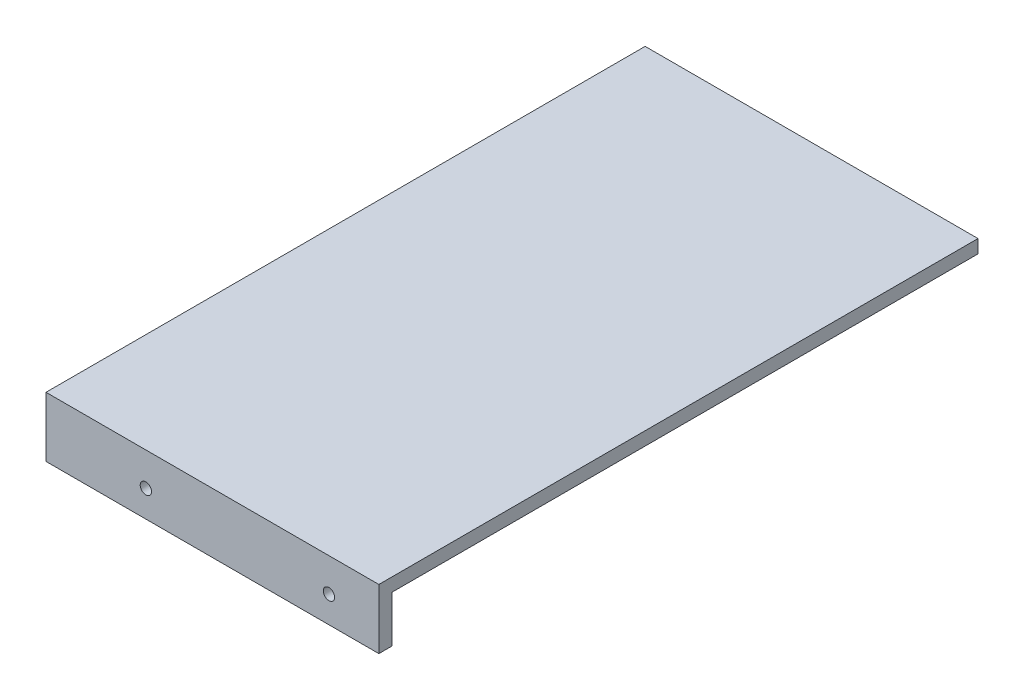
ISO-10303-21;
HEADER;
FILE_DESCRIPTION(('STEP AP214'),'2;1');
FILE_NAME('part.step','',(''),(''),'','','');
FILE_SCHEMA(('AUTOMOTIVE_DESIGN { 1 0 10303 214 1 1 1 1 }'));
ENDSEC;
DATA;
#1=APPLICATION_CONTEXT('core data for automotive mechanical design processes');
#2=APPLICATION_PROTOCOL_DEFINITION('international standard','automotive_design',2000,#1);
#3=PRODUCT_CONTEXT('',#1,'mechanical');
#4=PRODUCT('Part','Part','',(#3));
#5=PRODUCT_RELATED_PRODUCT_CATEGORY('part','',(#4));
#6=PRODUCT_DEFINITION_FORMATION('','',#4);
#7=PRODUCT_DEFINITION_CONTEXT('part definition',#1,'design');
#8=PRODUCT_DEFINITION('design','',#6,#7);
#9=PRODUCT_DEFINITION_SHAPE('','',#8);
#10=(LENGTH_UNIT() NAMED_UNIT(*) SI_UNIT(.MILLI.,.METRE.));
#11=(NAMED_UNIT(*) PLANE_ANGLE_UNIT() SI_UNIT($,.RADIAN.));
#12=(NAMED_UNIT(*) SI_UNIT($,.STERADIAN.) SOLID_ANGLE_UNIT());
#13=UNCERTAINTY_MEASURE_WITH_UNIT(LENGTH_MEASURE(1.E-05),#10,'distance_accuracy_value','');
#14=(GEOMETRIC_REPRESENTATION_CONTEXT(3) GLOBAL_UNCERTAINTY_ASSIGNED_CONTEXT((#13)) GLOBAL_UNIT_ASSIGNED_CONTEXT((#10,
#11,#12)) REPRESENTATION_CONTEXT('',''));
#15=CARTESIAN_POINT('',(0.,0.,0.));
#16=DIRECTION('',(0.,0.,1.));
#17=DIRECTION('',(1.,0.,0.));
#18=AXIS2_PLACEMENT_3D('',#15,#16,#17);
#19=CARTESIAN_POINT('',(-1643.16952854318,0.,0.));
#20=DIRECTION('',(1.,0.,0.));
#21=DIRECTION('',(0.,0.,-1.));
#22=AXIS2_PLACEMENT_3D('',#19,#20,#21);
#23=PLANE('',#22);
#24=CARTESIAN_POINT('',(-1643.16952854318,759.849345995239,1219.82566669182));
#25=DIRECTION('',(1.,0.,0.));
#26=DIRECTION('',(0.,1.,0.));
#27=AXIS2_PLACEMENT_3D('',#24,#25,#26);
#28=CIRCLE('',#27,1.69999999999995);
#29=CARTESIAN_POINT('',(-1643.16952854318,761.549345995239,1219.82566669182));
#30=VERTEX_POINT('',#29);
#31=EDGE_CURVE('E146',#30,#30,#28,.T.);
#32=ORIENTED_EDGE('',*,*,#31,.F.);
#33=EDGE_LOOP('',(#32));
#34=FACE_BOUND('',#33,.T.);
#35=CARTESIAN_POINT('',(-1643.16952854318,759.849345995239,1339.82566669182));
#36=DIRECTION('',(1.,0.,0.));
#37=DIRECTION('',(0.,1.,0.));
#38=AXIS2_PLACEMENT_3D('',#35,#36,#37);
#39=CIRCLE('',#38,1.69999999999995);
#40=CARTESIAN_POINT('',(-1643.16952854318,761.549345995239,1339.82566669182));
#41=VERTEX_POINT('',#40);
#42=EDGE_CURVE('E140',#41,#41,#39,.T.);
#43=ORIENTED_EDGE('',*,*,#42,.F.);
#44=EDGE_LOOP('',(#43));
#45=FACE_BOUND('',#44,.T.);
#46=DIRECTION('',(0.,1.,0.));
#47=VECTOR('',#46,1.);
#48=CARTESIAN_POINT('',(-1643.16952854318,769.849345995239,1189.82566669182));
#49=LINE('',#48,#47);
#50=CARTESIAN_POINT('',(-1643.16952854318,751.849345995239,1189.82566669182));
#51=VERTEX_POINT('',#50);
#52=CARTESIAN_POINT('',(-1643.16952854318,765.849345995238,1189.82566669182));
#53=VERTEX_POINT('',#52);
#54=EDGE_CURVE('E48',#51,#53,#49,.T.);
#55=ORIENTED_EDGE('',*,*,#54,.T.);
#56=DIRECTION('',(0.,0.,1.));
#57=VECTOR('',#56,1.);
#58=CARTESIAN_POINT('',(-1643.16952854318,765.849345995238,1093.74236949611));
#59=LINE('',#58,#57);
#60=CARTESIAN_POINT('',(-1643.16952854318,765.849345995238,1365.82566669183));
#61=VERTEX_POINT('',#60);
#62=EDGE_CURVE('E53',#53,#61,#59,.T.);
#63=ORIENTED_EDGE('',*,*,#62,.T.);
#64=DIRECTION('',(0.,-1.,0.));
#65=VECTOR('',#64,1.);
#66=CARTESIAN_POINT('',(-1643.16952854318,0.,1365.82566669183));
#67=LINE('',#66,#65);
#68=CARTESIAN_POINT('',(-1643.16952854318,751.849345995251,1365.82566669183));
#69=VERTEX_POINT('',#68);
#70=EDGE_CURVE('E110',#61,#69,#67,.T.);
#71=ORIENTED_EDGE('',*,*,#70,.T.);
#72=DIRECTION('',(0.,0.,-1.));
#73=VECTOR('',#72,1.);
#74=CARTESIAN_POINT('',(-1643.16952854318,751.849345995239,1369.82566669182));
#75=LINE('',#74,#73);
#76=EDGE_CURVE('E152',#69,#51,#75,.T.);
#77=ORIENTED_EDGE('',*,*,#76,.T.);
#78=EDGE_LOOP('',(#55,#63,#71,#77));
#79=FACE_BOUND('',#78,.T.);
#80=ADVANCED_FACE('F33',(#34,#45,#79),#23,.T.);
#81=CARTESIAN_POINT('',(6.06928205417968E-12,0.,1365.82566669182));
#82=DIRECTION('',(0.,0.,1.));
#83=DIRECTION('',(1.,0.,0.));
#84=AXIS2_PLACEMENT_3D('',#81,#82,#83);
#85=PLANE('',#84);
#86=CARTESIAN_POINT('',(-1562.16952854317,759.849345995251,1365.82566669183));
#87=DIRECTION('',(0.,0.,-1.));
#88=DIRECTION('',(-1.,0.,0.));
#89=AXIS2_PLACEMENT_3D('',#86,#87,#88);
#90=CIRCLE('',#89,1.69999999999995);
#91=CARTESIAN_POINT('',(-1563.86952854317,759.849345995251,1365.82566669183));
#92=VERTEX_POINT('',#91);
#93=EDGE_CURVE('E120',#92,#92,#90,.T.);
#94=ORIENTED_EDGE('',*,*,#93,.F.);
#95=EDGE_LOOP('',(#94));
#96=FACE_BOUND('',#95,.T.);
#97=CARTESIAN_POINT('',(-1617.16952854317,759.849345995251,1365.82566669183));
#98=DIRECTION('',(0.,0.,-1.));
#99=DIRECTION('',(-1.,0.,0.));
#100=AXIS2_PLACEMENT_3D('',#97,#98,#99);
#101=CIRCLE('',#100,1.69999999999995);
#102=CARTESIAN_POINT('',(-1618.86952854317,759.849345995251,1365.82566669183));
#103=VERTEX_POINT('',#102);
#104=EDGE_CURVE('E127',#103,#103,#101,.T.);
#105=ORIENTED_EDGE('',*,*,#104,.F.);
#106=EDGE_LOOP('',(#105));
#107=FACE_BOUND('',#106,.T.);
#108=DIRECTION('',(-1.,0.,0.));
#109=VECTOR('',#108,1.);
#110=CARTESIAN_POINT('',(-1547.16952854317,765.849345995238,1365.82566669183));
#111=LINE('',#110,#109);
#112=CARTESIAN_POINT('',(-1547.16952854317,765.849345995238,1365.82566669183));
#113=VERTEX_POINT('',#112);
#114=EDGE_CURVE('E108',#113,#61,#111,.T.);
#115=ORIENTED_EDGE('',*,*,#114,.F.);
#116=DIRECTION('',(0.,-1.,0.));
#117=VECTOR('',#116,1.);
#118=CARTESIAN_POINT('',(-1547.16952854317,769.849345995238,1365.82566669183));
#119=LINE('',#118,#117);
#120=CARTESIAN_POINT('',(-1547.16952854317,751.849345995251,1365.82566669183));
#121=VERTEX_POINT('',#120);
#122=EDGE_CURVE('E91',#113,#121,#119,.T.);
#123=ORIENTED_EDGE('',*,*,#122,.T.);
#124=DIRECTION('',(-1.,0.,0.));
#125=VECTOR('',#124,1.);
#126=CARTESIAN_POINT('',(-1647.16952854317,751.849345995251,1365.82566669183));
#127=LINE('',#126,#125);
#128=EDGE_CURVE('E104',#121,#69,#127,.T.);
#129=ORIENTED_EDGE('',*,*,#128,.T.);
#130=ORIENTED_EDGE('',*,*,#70,.F.);
#131=EDGE_LOOP('',(#115,#123,#129,#130));
#132=FACE_BOUND('',#131,.T.);
#133=ADVANCED_FACE('F109',(#96,#107,#132),#85,.F.);
#134=CARTESIAN_POINT('',(-1647.16952854318,0.,0.));
#135=DIRECTION('',(1.,0.,0.));
#136=DIRECTION('',(0.,0.,-1.));
#137=AXIS2_PLACEMENT_3D('',#134,#135,#136);
#138=PLANE('',#137);
#139=DIRECTION('',(0.,-1.,0.));
#140=VECTOR('',#139,1.);
#141=CARTESIAN_POINT('',(-1647.16952854318,769.849345995239,1369.82566669182));
#142=LINE('',#141,#140);
#143=CARTESIAN_POINT('',(-1647.16952854318,769.849345995239,1369.82566669182));
#144=VERTEX_POINT('',#143);
#145=CARTESIAN_POINT('',(-1647.16952854318,751.849345995239,1369.82566669182));
#146=VERTEX_POINT('',#145);
#147=EDGE_CURVE('E149',#144,#146,#142,.T.);
#148=ORIENTED_EDGE('',*,*,#147,.F.);
#149=DIRECTION('',(0.,0.,1.));
#150=VECTOR('',#149,1.);
#151=CARTESIAN_POINT('',(-1647.16952854318,769.849345995239,1369.82566669182));
#152=LINE('',#151,#150);
#153=CARTESIAN_POINT('',(-1647.16952854318,769.849345995239,1189.82566669182));
#154=VERTEX_POINT('',#153);
#155=EDGE_CURVE('E154',#154,#144,#152,.T.);
#156=ORIENTED_EDGE('',*,*,#155,.F.);
#157=DIRECTION('',(0.,1.,0.));
#158=VECTOR('',#157,1.);
#159=CARTESIAN_POINT('',(-1647.16952854318,769.849345995239,1189.82566669182));
#160=LINE('',#159,#158);
#161=CARTESIAN_POINT('',(-1647.16952854318,751.849345995239,1189.82566669182));
#162=VERTEX_POINT('',#161);
#163=EDGE_CURVE('E161',#162,#154,#160,.T.);
#164=ORIENTED_EDGE('',*,*,#163,.F.);
#165=DIRECTION('',(0.,0.,-1.));
#166=VECTOR('',#165,1.);
#167=CARTESIAN_POINT('',(-1647.16952854318,751.849345995239,1369.82566669182));
#168=LINE('',#167,#166);
#169=EDGE_CURVE('E159',#146,#162,#168,.T.);
#170=ORIENTED_EDGE('',*,*,#169,.F.);
#171=EDGE_LOOP('',(#148,#156,#164,#170));
#172=FACE_BOUND('',#171,.T.);
#173=CARTESIAN_POINT('',(-1647.16952854318,759.849345995239,1339.82566669182));
#174=DIRECTION('',(1.,0.,0.));
#175=DIRECTION('',(0.,1.,0.));
#176=AXIS2_PLACEMENT_3D('',#173,#174,#175);
#177=CIRCLE('',#176,1.69999999999995);
#178=CARTESIAN_POINT('',(-1647.16952854318,761.549345995239,1339.82566669182));
#179=VERTEX_POINT('',#178);
#180=EDGE_CURVE('E139',#179,#179,#177,.T.);
#181=ORIENTED_EDGE('',*,*,#180,.T.);
#182=EDGE_LOOP('',(#181));
#183=FACE_BOUND('',#182,.T.);
#184=CARTESIAN_POINT('',(-1647.16952854318,759.849345995239,1219.82566669182));
#185=DIRECTION('',(1.,0.,0.));
#186=DIRECTION('',(0.,1.,0.));
#187=AXIS2_PLACEMENT_3D('',#184,#185,#186);
#188=CIRCLE('',#187,1.69999999999995);
#189=CARTESIAN_POINT('',(-1647.16952854318,761.549345995239,1219.82566669182));
#190=VERTEX_POINT('',#189);
#191=EDGE_CURVE('E143',#190,#190,#188,.T.);
#192=ORIENTED_EDGE('',*,*,#191,.T.);
#193=EDGE_LOOP('',(#192));
#194=FACE_BOUND('',#193,.T.);
#195=ADVANCED_FACE('F178',(#172,#183,#194),#138,.F.);
#196=CARTESIAN_POINT('',(-1643.16952854318,769.849345995239,1369.82566669182));
#197=DIRECTION('',(0.,0.,-1.));
#198=DIRECTION('',(-1.,0.,0.));
#199=AXIS2_PLACEMENT_3D('',#196,#197,#198);
#200=PLANE('',#199);
#201=ORIENTED_EDGE('',*,*,#147,.T.);
#202=DIRECTION('',(-1.,0.,0.));
#203=VECTOR('',#202,1.);
#204=CARTESIAN_POINT('',(-1643.16952854318,751.849345995239,1369.82566669182));
#205=LINE('',#204,#203);
#206=CARTESIAN_POINT('',(-1547.16952854317,751.849345995251,1369.82566669183));
#207=VERTEX_POINT('',#206);
#208=EDGE_CURVE('E11',#207,#146,#205,.T.);
#209=ORIENTED_EDGE('',*,*,#208,.F.);
#210=DIRECTION('',(0.,-1.,0.));
#211=VECTOR('',#210,1.);
#212=CARTESIAN_POINT('',(-1547.16952854317,769.849345995238,1369.82566669183));
#213=LINE('',#212,#211);
#214=CARTESIAN_POINT('',(-1547.16952854317,769.849345995238,1369.82566669183));
#215=VERTEX_POINT('',#214);
#216=EDGE_CURVE('E105',#215,#207,#213,.T.);
#217=ORIENTED_EDGE('',*,*,#216,.F.);
#218=DIRECTION('',(-1.,0.,0.));
#219=VECTOR('',#218,1.);
#220=CARTESIAN_POINT('',(-1643.16952854318,769.849345995239,1369.82566669182));
#221=LINE('',#220,#219);
#222=EDGE_CURVE('E156',#215,#144,#221,.T.);
#223=ORIENTED_EDGE('',*,*,#222,.T.);
#224=EDGE_LOOP('',(#201,#209,#217,#223));
#225=FACE_BOUND('',#224,.T.);
#226=CARTESIAN_POINT('',(-1617.16952854317,759.849345995251,1369.82566669183));
#227=DIRECTION('',(0.,0.,-1.));
#228=DIRECTION('',(-1.,0.,0.));
#229=AXIS2_PLACEMENT_3D('',#226,#227,#228);
#230=CIRCLE('',#229,1.69999999999995);
#231=CARTESIAN_POINT('',(-1618.86952854317,759.849345995251,1369.82566669183));
#232=VERTEX_POINT('',#231);
#233=EDGE_CURVE('E123',#232,#232,#230,.T.);
#234=ORIENTED_EDGE('',*,*,#233,.T.);
#235=EDGE_LOOP('',(#234));
#236=FACE_BOUND('',#235,.T.);
#237=CARTESIAN_POINT('',(-1562.16952854317,759.849345995251,1369.82566669183));
#238=DIRECTION('',(0.,0.,-1.));
#239=DIRECTION('',(-1.,0.,0.));
#240=AXIS2_PLACEMENT_3D('',#237,#238,#239);
#241=CIRCLE('',#240,1.69999999999995);
#242=CARTESIAN_POINT('',(-1563.86952854317,759.849345995251,1369.82566669183));
#243=VERTEX_POINT('',#242);
#244=EDGE_CURVE('E124',#243,#243,#241,.T.);
#245=ORIENTED_EDGE('',*,*,#244,.T.);
#246=EDGE_LOOP('',(#245));
#247=FACE_BOUND('',#246,.T.);
#248=ADVANCED_FACE('F35',(#225,#236,#247),#200,.F.);
#249=CARTESIAN_POINT('',(-1643.16952854318,751.849345995239,1369.82566669182));
#250=DIRECTION('',(0.,1.,0.));
#251=DIRECTION('',(-1.,0.,0.));
#252=AXIS2_PLACEMENT_3D('',#249,#250,#251);
#253=PLANE('',#252);
#254=ORIENTED_EDGE('',*,*,#169,.T.);
#255=DIRECTION('',(-1.,0.,0.));
#256=VECTOR('',#255,1.);
#257=CARTESIAN_POINT('',(-1643.16952854318,751.849345995239,1189.82566669182));
#258=LINE('',#257,#256);
#259=EDGE_CURVE('E41',#51,#162,#258,.T.);
#260=ORIENTED_EDGE('',*,*,#259,.F.);
#261=ORIENTED_EDGE('',*,*,#76,.F.);
#262=ORIENTED_EDGE('',*,*,#128,.F.);
#263=DIRECTION('',(0.,0.,1.));
#264=VECTOR('',#263,1.);
#265=CARTESIAN_POINT('',(-1547.16952854317,751.849345995251,1365.82566669183));
#266=LINE('',#265,#264);
#267=EDGE_CURVE('E100',#121,#207,#266,.T.);
#268=ORIENTED_EDGE('',*,*,#267,.T.);
#269=ORIENTED_EDGE('',*,*,#208,.T.);
#270=EDGE_LOOP('',(#254,#260,#261,#262,#268,#269));
#271=FACE_BOUND('',#270,.T.);
#272=ADVANCED_FACE('F186',(#271),#253,.F.);
#273=CARTESIAN_POINT('',(-1643.16952854318,769.849345995239,1189.82566669182));
#274=DIRECTION('',(0.,0.,1.));
#275=DIRECTION('',(1.,0.,0.));
#276=AXIS2_PLACEMENT_3D('',#273,#274,#275);
#277=PLANE('',#276);
#278=ORIENTED_EDGE('',*,*,#163,.T.);
#279=DIRECTION('',(-1.,0.,0.));
#280=VECTOR('',#279,1.);
#281=CARTESIAN_POINT('',(-1643.16952854318,769.849345995239,1189.82566669182));
#282=LINE('',#281,#280);
#283=CARTESIAN_POINT('',(-1547.16952854317,769.849345995238,1189.82566669182));
#284=VERTEX_POINT('',#283);
#285=EDGE_CURVE('E166',#284,#154,#282,.T.);
#286=ORIENTED_EDGE('',*,*,#285,.F.);
#287=DIRECTION('',(0.,1.,0.));
#288=VECTOR('',#287,1.);
#289=CARTESIAN_POINT('',(-1547.16952854317,769.849345995238,1189.82566669182));
#290=LINE('',#289,#288);
#291=CARTESIAN_POINT('',(-1547.16952854317,765.849345995238,1189.82566669182));
#292=VERTEX_POINT('',#291);
#293=EDGE_CURVE('E116',#292,#284,#290,.T.);
#294=ORIENTED_EDGE('',*,*,#293,.F.);
#295=DIRECTION('',(1.,0.,0.));
#296=VECTOR('',#295,1.);
#297=CARTESIAN_POINT('',(-1547.16952854318,765.849345995238,1189.82566669182));
#298=LINE('',#297,#296);
#299=EDGE_CURVE('E114',#53,#292,#298,.T.);
#300=ORIENTED_EDGE('',*,*,#299,.F.);
#301=ORIENTED_EDGE('',*,*,#54,.F.);
#302=ORIENTED_EDGE('',*,*,#259,.T.);
#303=EDGE_LOOP('',(#278,#286,#294,#300,#301,#302));
#304=FACE_BOUND('',#303,.T.);
#305=ADVANCED_FACE('F172',(#304),#277,.F.);
#306=CARTESIAN_POINT('',(-1643.16952854318,769.849345995239,1369.82566669182));
#307=DIRECTION('',(0.,-1.,0.));
#308=DIRECTION('',(1.,0.,0.));
#309=AXIS2_PLACEMENT_3D('',#306,#307,#308);
#310=PLANE('',#309);
#311=ORIENTED_EDGE('',*,*,#222,.F.);
#312=DIRECTION('',(0.,0.,1.));
#313=VECTOR('',#312,1.);
#314=CARTESIAN_POINT('',(-1547.16952854317,769.849345995238,1365.82566669183));
#315=LINE('',#314,#313);
#316=EDGE_CURVE('E135',#284,#215,#315,.T.);
#317=ORIENTED_EDGE('',*,*,#316,.F.);
#318=ORIENTED_EDGE('',*,*,#285,.T.);
#319=ORIENTED_EDGE('',*,*,#155,.T.);
#320=EDGE_LOOP('',(#311,#317,#318,#319));
#321=FACE_BOUND('',#320,.T.);
#322=ADVANCED_FACE('F181',(#321),#310,.F.);
#323=CARTESIAN_POINT('',(-1643.16952854318,759.849345995239,1219.82566669182));
#324=DIRECTION('',(-1.,0.,0.));
#325=DIRECTION('',(0.,-1.,0.));
#326=AXIS2_PLACEMENT_3D('',#323,#324,#325);
#327=CYLINDRICAL_SURFACE('',#326,1.69999999999995);
#328=ORIENTED_EDGE('',*,*,#31,.T.);
#329=EDGE_LOOP('',(#328));
#330=FACE_BOUND('',#329,.T.);
#331=ORIENTED_EDGE('',*,*,#191,.F.);
#332=EDGE_LOOP('',(#331));
#333=FACE_BOUND('',#332,.T.);
#334=ADVANCED_FACE('F199',(#330,#333),#327,.F.);
#335=CARTESIAN_POINT('',(-1643.16952854318,759.849345995239,1339.82566669182));
#336=DIRECTION('',(-1.,0.,0.));
#337=DIRECTION('',(0.,-1.,0.));
#338=AXIS2_PLACEMENT_3D('',#335,#336,#337);
#339=CYLINDRICAL_SURFACE('',#338,1.69999999999995);
#340=ORIENTED_EDGE('',*,*,#42,.T.);
#341=EDGE_LOOP('',(#340));
#342=FACE_BOUND('',#341,.T.);
#343=ORIENTED_EDGE('',*,*,#180,.F.);
#344=EDGE_LOOP('',(#343));
#345=FACE_BOUND('',#344,.T.);
#346=ADVANCED_FACE('F250',(#342,#345),#339,.F.);
#347=CARTESIAN_POINT('',(-1547.16952854317,769.849345995238,1365.82566669183));
#348=DIRECTION('',(-1.,0.,0.));
#349=DIRECTION('',(0.,0.,1.));
#350=AXIS2_PLACEMENT_3D('',#347,#348,#349);
#351=PLANE('',#350);
#352=ORIENTED_EDGE('',*,*,#216,.T.);
#353=ORIENTED_EDGE('',*,*,#267,.F.);
#354=ORIENTED_EDGE('',*,*,#122,.F.);
#355=DIRECTION('',(0.,0.,1.));
#356=VECTOR('',#355,1.);
#357=CARTESIAN_POINT('',(-1547.16952854318,765.849345995238,1093.74236949611));
#358=LINE('',#357,#356);
#359=EDGE_CURVE('E97',#292,#113,#358,.T.);
#360=ORIENTED_EDGE('',*,*,#359,.F.);
#361=ORIENTED_EDGE('',*,*,#293,.T.);
#362=ORIENTED_EDGE('',*,*,#316,.T.);
#363=EDGE_LOOP('',(#352,#353,#354,#360,#361,#362));
#364=FACE_BOUND('',#363,.T.);
#365=ADVANCED_FACE('F94',(#364),#351,.F.);
#366=CARTESIAN_POINT('',(-1617.16952854317,759.849345995251,1365.82566669183));
#367=DIRECTION('',(0.,0.,1.));
#368=DIRECTION('',(1.,0.,0.));
#369=AXIS2_PLACEMENT_3D('',#366,#367,#368);
#370=CYLINDRICAL_SURFACE('',#369,1.69999999999995);
#371=ORIENTED_EDGE('',*,*,#104,.T.);
#372=EDGE_LOOP('',(#371));
#373=FACE_BOUND('',#372,.T.);
#374=ORIENTED_EDGE('',*,*,#233,.F.);
#375=EDGE_LOOP('',(#374));
#376=FACE_BOUND('',#375,.T.);
#377=ADVANCED_FACE('F249',(#373,#376),#370,.F.);
#378=CARTESIAN_POINT('',(-1562.16952854317,759.849345995251,1365.82566669183));
#379=DIRECTION('',(0.,0.,1.));
#380=DIRECTION('',(1.,0.,0.));
#381=AXIS2_PLACEMENT_3D('',#378,#379,#380);
#382=CYLINDRICAL_SURFACE('',#381,1.69999999999995);
#383=ORIENTED_EDGE('',*,*,#93,.T.);
#384=EDGE_LOOP('',(#383));
#385=FACE_BOUND('',#384,.T.);
#386=ORIENTED_EDGE('',*,*,#244,.F.);
#387=EDGE_LOOP('',(#386));
#388=FACE_BOUND('',#387,.T.);
#389=ADVANCED_FACE('F261',(#385,#388),#382,.F.);
#390=CARTESIAN_POINT('',(-1547.16952854318,765.849345995238,1093.74236949611));
#391=DIRECTION('',(0.,1.,0.));
#392=DIRECTION('',(0.,0.,1.));
#393=AXIS2_PLACEMENT_3D('',#390,#391,#392);
#394=PLANE('',#393);
#395=ORIENTED_EDGE('',*,*,#62,.F.);
#396=ORIENTED_EDGE('',*,*,#299,.T.);
#397=ORIENTED_EDGE('',*,*,#359,.T.);
#398=ORIENTED_EDGE('',*,*,#114,.T.);
#399=EDGE_LOOP('',(#395,#396,#397,#398));
#400=FACE_BOUND('',#399,.T.);
#401=ADVANCED_FACE('F113',(#400),#394,.F.);
#402=CLOSED_SHELL('',(#80,#133,#195,#248,#272,#305,#322,#334,#346,#365,#377,#389,#401));
#403=MANIFOLD_SOLID_BREP('B2',#402);
#404=ADVANCED_BREP_SHAPE_REPRESENTATION('',(#18,#403),#14);
#405=SHAPE_DEFINITION_REPRESENTATION(#9,#404);
ENDSEC;
END-ISO-10303-21;
